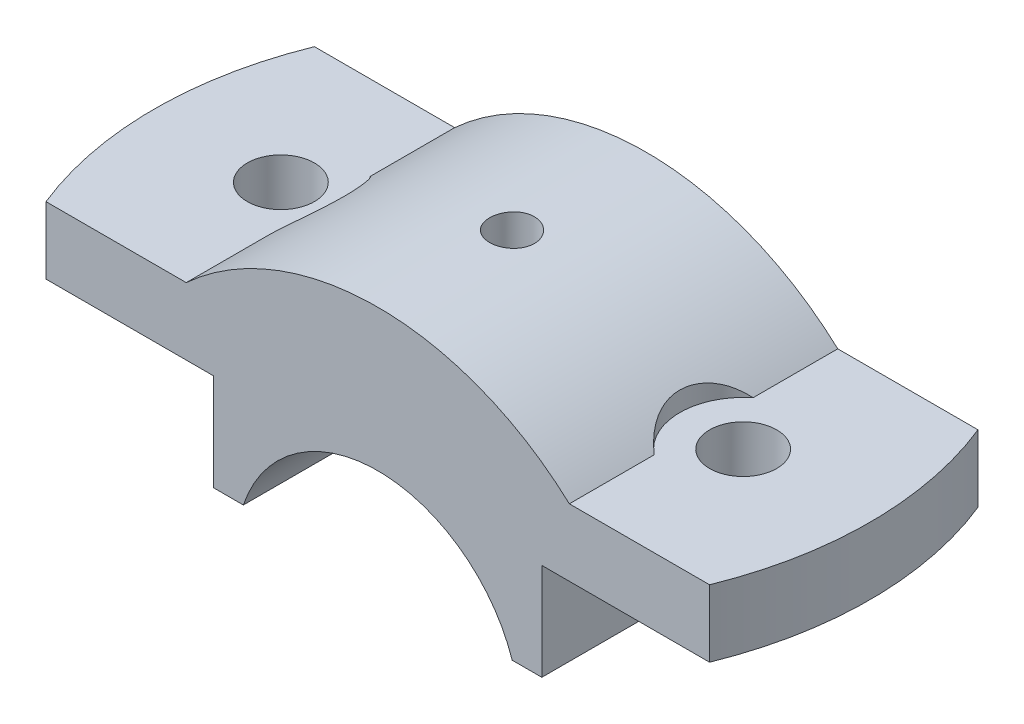
ISO-10303-21;
HEADER;
FILE_DESCRIPTION(('STEP AP214'),'2;1');
FILE_NAME('part.step','',(''),(''),'','','');
FILE_SCHEMA(('AUTOMOTIVE_DESIGN { 1 0 10303 214 1 1 1 1 }'));
ENDSEC;
DATA;
#1=APPLICATION_CONTEXT('core data for automotive mechanical design processes');
#2=APPLICATION_PROTOCOL_DEFINITION('international standard','automotive_design',2000,#1);
#3=PRODUCT_CONTEXT('',#1,'mechanical');
#4=PRODUCT('Part','Part','',(#3));
#5=PRODUCT_RELATED_PRODUCT_CATEGORY('part','',(#4));
#6=PRODUCT_DEFINITION_FORMATION('','',#4);
#7=PRODUCT_DEFINITION_CONTEXT('part definition',#1,'design');
#8=PRODUCT_DEFINITION('design','',#6,#7);
#9=PRODUCT_DEFINITION_SHAPE('','',#8);
#10=(LENGTH_UNIT() NAMED_UNIT(*) SI_UNIT(.MILLI.,.METRE.));
#11=(NAMED_UNIT(*) PLANE_ANGLE_UNIT() SI_UNIT($,.RADIAN.));
#12=(NAMED_UNIT(*) SI_UNIT($,.STERADIAN.) SOLID_ANGLE_UNIT());
#13=UNCERTAINTY_MEASURE_WITH_UNIT(LENGTH_MEASURE(1.E-05),#10,'distance_accuracy_value','');
#14=(GEOMETRIC_REPRESENTATION_CONTEXT(3) GLOBAL_UNCERTAINTY_ASSIGNED_CONTEXT((#13)) GLOBAL_UNIT_ASSIGNED_CONTEXT((#10,
#11,#12)) REPRESENTATION_CONTEXT('',''));
#15=CARTESIAN_POINT('',(0.,0.,0.));
#16=DIRECTION('',(0.,0.,1.));
#17=DIRECTION('',(1.,0.,0.));
#18=AXIS2_PLACEMENT_3D('',#15,#16,#17);
#19=CARTESIAN_POINT('',(0.,0.,18.));
#20=DIRECTION('',(0.,0.,-1.));
#21=DIRECTION('',(-1.,0.,0.));
#22=AXIS2_PLACEMENT_3D('',#19,#20,#21);
#23=CYLINDRICAL_SURFACE('',#22,38.);
#24=CARTESIAN_POINT('',(0.,38.,3.));
#25=CARTESIAN_POINT('',(-0.168230277437706,37.9999984430739,2.99999263868346));
#26=CARTESIAN_POINT('',(-0.336575845655095,37.9988709200709,2.98580169916932));
#27=CARTESIAN_POINT('',(-0.668611397196742,37.9944814128081,2.92939894930334));
#28=CARTESIAN_POINT('',(-0.832295850092009,37.9912169949171,2.88715518982943));
#29=CARTESIAN_POINT('',(-1.15015205512757,37.9829226863334,2.77587406357067));
#30=CARTESIAN_POINT('',(-1.3043290493551,37.9778937789402,2.70685161752221));
#31=CARTESIAN_POINT('',(-1.59887136159142,37.9666348413683,2.54399853963546));
#32=CARTESIAN_POINT('',(-1.73923967362019,37.9604050724332,2.45017330191646));
#33=CARTESIAN_POINT('',(-2.00254103126273,37.9474277075509,2.24014409327319));
#34=CARTESIAN_POINT('',(-2.12543792166293,37.9406790810774,2.1238948563935));
#35=CARTESIAN_POINT('',(-2.34999780988339,37.9274332919605,1.87241281605956));
#36=CARTESIAN_POINT('',(-2.45165988585508,37.9209361402441,1.73717918887839));
#37=CARTESIAN_POINT('',(-2.63098484586303,37.9089176287414,1.45135065682847));
#38=CARTESIAN_POINT('',(-2.708616254697,37.903397552738,1.30073594623715));
#39=CARTESIAN_POINT('',(-2.83747510230931,37.8939696224707,0.988558849059876));
#40=CARTESIAN_POINT('',(-2.8887029645124,37.8900617423529,0.826996638082311));
#41=CARTESIAN_POINT('',(-2.96319644645853,37.8843090780475,0.497870679819642));
#42=CARTESIAN_POINT('',(-2.98652059882487,37.8824599758018,0.33032025735777));
#43=CARTESIAN_POINT('',(-3.00472536931326,37.8810204867557,-0.00632681714998032));
#44=CARTESIAN_POINT('',(-2.99960647157769,37.8814300615093,-0.175423442828302));
#45=CARTESIAN_POINT('',(-2.96111886260011,37.8844577346025,-0.509962310035282));
#46=CARTESIAN_POINT('',(-2.92781369865023,37.8870708648728,-0.675411913710737));
#47=CARTESIAN_POINT('',(-2.83399765916123,37.8942034046858,-0.998365215123264));
#48=CARTESIAN_POINT('',(-2.77348654183749,37.8987228311701,-1.15586884222906));
#49=CARTESIAN_POINT('',(-2.62690490032728,37.9091644380148,-1.45866214971911));
#50=CARTESIAN_POINT('',(-2.5408057912968,37.9150881856644,-1.60393793599879));
#51=CARTESIAN_POINT('',(-2.34551283184453,37.9276694800349,-1.87799978791044));
#52=CARTESIAN_POINT('',(-2.23631856235736,37.9343270400699,-2.0067855542603));
#53=CARTESIAN_POINT('',(-1.99757813910437,37.947647885739,-2.24458115896057));
#54=CARTESIAN_POINT('',(-1.86797703439473,37.9543111370687,-2.35353583758634));
#55=CARTESIAN_POINT('',(-1.59229376436977,37.9668751419437,-2.54815019879117));
#56=CARTESIAN_POINT('',(-1.44621158946689,37.9727758950454,-2.63380986781872));
#57=CARTESIAN_POINT('',(-1.14167761997914,37.983150993084,-2.77939892547026));
#58=CARTESIAN_POINT('',(-0.98322469233549,37.9876252071703,-2.83932595392176));
#59=CARTESIAN_POINT('',(-0.658463212690179,37.9946415451888,-2.93171041942903));
#60=CARTESIAN_POINT('',(-0.492154807064348,37.997183705107,-2.96416836811962));
#61=CARTESIAN_POINT('',(-0.156881478742687,38.0000448768352,-3.00062434440681));
#62=CARTESIAN_POINT('',(0.0120751089608354,38.0003698415183,-3.00469857910482));
#63=CARTESIAN_POINT('',(0.348269003373997,37.9987758913175,-2.98447098943403));
#64=CARTESIAN_POINT('',(0.515506324442481,37.9968569951891,-2.96016940224689));
#65=CARTESIAN_POINT('',(0.843297753735753,37.9909950041868,-2.88394314979588));
#66=CARTESIAN_POINT('',(1.00386010671882,37.987054491835,-2.83205372367032));
#67=CARTESIAN_POINT('',(1.31399900365978,37.9775920824189,-2.70216068710783));
#68=CARTESIAN_POINT('',(1.46357539119334,37.972070162843,-2.62415670492505));
#69=CARTESIAN_POINT('',(1.74784375041781,37.9600494395666,-2.4440567104013));
#70=CARTESIAN_POINT('',(1.88250358772923,37.953548595394,-2.34191011569746));
#71=CARTESIAN_POINT('',(2.13279217984117,37.9403075453845,-2.1164976605111));
#72=CARTESIAN_POINT('',(2.24842063776818,37.9335673358158,-1.99323147064188));
#73=CARTESIAN_POINT('',(2.45762484975141,37.9205896766453,-1.72874864835166));
#74=CARTESIAN_POINT('',(2.55115094155127,37.9143533795852,-1.5874926690468));
#75=CARTESIAN_POINT('',(2.71315523827201,37.9031055627809,-1.29123629441747));
#76=CARTESIAN_POINT('',(2.78163367119924,37.8980940318878,-1.1362360242219));
#77=CARTESIAN_POINT('',(2.89151387110069,37.8898693720601,-0.817068099787171));
#78=CARTESIAN_POINT('',(2.93294623887225,37.8866542112497,-0.652911034998949));
#79=CARTESIAN_POINT('',(2.98765790023767,37.8823793491511,-0.319943850373175));
#80=CARTESIAN_POINT('',(3.00093767292138,37.8813196111828,-0.151133809767671));
#81=CARTESIAN_POINT('',(2.99896188688676,37.8814760426207,0.185853858942921));
#82=CARTESIAN_POINT('',(2.98378436644712,37.8826859878913,0.354031953001598));
#83=CARTESIAN_POINT('',(2.92548733876923,37.887232237977,0.685442873019109));
#84=CARTESIAN_POINT('',(2.8823677867555,37.8905685461995,0.848675691052987));
#85=CARTESIAN_POINT('',(2.76943001015431,37.8989899804525,1.16556899687011));
#86=CARTESIAN_POINT('',(2.69961296444522,37.9040750292632,1.31922990697071));
#87=CARTESIAN_POINT('',(2.535271096382,37.9154210711218,1.61266178094886));
#88=CARTESIAN_POINT('',(2.44074672054795,37.9216820429175,1.75243299578316));
#89=CARTESIAN_POINT('',(2.2293806238227,37.9346948182221,2.01451680288399));
#90=CARTESIAN_POINT('',(2.11248130954252,37.941447859921,2.13678288515433));
#91=CARTESIAN_POINT('',(1.85978424897896,37.954672635902,2.36000556130417));
#92=CARTESIAN_POINT('',(1.72398192526551,37.9611443015481,2.46095697881558));
#93=CARTESIAN_POINT('',(1.43709756450134,37.9730876131211,2.63880542567551));
#94=CARTESIAN_POINT('',(1.28598975831931,37.978557527474,2.71566096437293));
#95=CARTESIAN_POINT('',(0.973076064569833,37.9878601967286,2.84281200189951));
#96=CARTESIAN_POINT('',(0.811282773093933,37.9916948408735,2.89313816633252));
#97=CARTESIAN_POINT('',(0.540438770546247,37.9963056825779,2.95292296572034));
#98=CARTESIAN_POINT('',(0.433132098217291,37.9976847801056,2.97055353917028));
#99=CARTESIAN_POINT('',(0.217232975456251,37.9995324404705,2.99409441950641));
#100=CARTESIAN_POINT('',(0.108640528034263,38.0000010054389,3.0000047538251));
#101=CARTESIAN_POINT('',(0.,38.,3.));
#102=B_SPLINE_CURVE_WITH_KNOTS('',3,(#24,#25,#26,#27,#28,#29,#30,#31,#32,#33,#34,#35,#36,#37,
#38,#39,#40,#41,#42,#43,#44,#45,#46,#47,#48,#49,#50,#51,#52,#53,#54,#55,#56,#57,#58,#59,#60,#61,
#62,#63,#64,#65,#66,#67,#68,#69,#70,#71,#72,#73,#74,#75,#76,#77,#78,#79,#80,#81,#82,#83,#84,#85,
#86,#87,#88,#89,#90,#91,#92,#93,#94,#95,#96,#97,#98,#99,#100,#101),.UNSPECIFIED.,.T.,.F.,(4,2,2,
2,2,2,2,2,2,2,2,2,2,2,2,2,2,2,2,2,2,2,2,2,2,2,2,2,2,2,2,2,2,2,2,2,2,2,4),(0.,0.504294188546741,
1.00916370078727,1.51375230936014,2.01823126998903,2.5237394549149,3.0292695804704,
3.53545907123702,4.04164044416132,4.54675814609822,5.05186725021796,5.55584058602809,
6.05981840083594,6.56436134901273,7.06891345298729,7.57484819748389,8.0807832362998,
8.5867646690735,9.09273667730812,9.59734968185781,10.1019584685879,10.6059242398503,
11.1098971854695,11.614935538604,12.1199817691652,12.6261522324058,13.1323180879118,
13.6379102536977,14.1434938154447,14.6476929456065,15.1518928837201,15.6560705605014,
16.1602391262259,16.6657233184336,17.1713301290485,17.6778028214878,18.183688785524,
18.5093549854357,18.8350204230892),.UNSPECIFIED.);
#103=CARTESIAN_POINT('',(0.,38.,3.));
#104=VERTEX_POINT('',#103);
#105=EDGE_CURVE('E11',#104,#104,#102,.T.);
#106=ORIENTED_EDGE('',*,*,#105,.T.);
#107=EDGE_LOOP('',(#106));
#108=FACE_BOUND('',#107,.T.);
#109=DIRECTION('',(0.,0.,-1.));
#110=VECTOR('',#109,1.);
#111=CARTESIAN_POINT('',(25.6904651573303,28.,18.));
#112=LINE('',#111,#110);
#113=CARTESIAN_POINT('',(25.6904651573303,28.,18.));
#114=VERTEX_POINT('',#113);
#115=CARTESIAN_POINT('',(25.6904651573303,28.,6.63768331230679));
#116=VERTEX_POINT('',#115);
#117=EDGE_CURVE('E148',#114,#116,#112,.T.);
#118=ORIENTED_EDGE('',*,*,#117,.T.);
#119=CARTESIAN_POINT('',(25.6904651573303,28.,6.63768331230679));
#120=CARTESIAN_POINT('',(25.5360851043424,28.1416681018721,6.51420867249736));
#121=CARTESIAN_POINT('',(25.3836215551735,28.2791823336498,6.38340380017067));
#122=CARTESIAN_POINT('',(25.0841053598261,28.5451833866574,6.1068595072457));
#123=CARTESIAN_POINT('',(24.9370580895264,28.6736613482156,5.96110576476093));
#124=CARTESIAN_POINT('',(24.6491941230388,28.9215085426633,5.653491442262));
#125=CARTESIAN_POINT('',(24.508431723833,29.0408031542341,5.49151942353939));
#126=CARTESIAN_POINT('',(24.2363075607749,29.2682904084011,5.15263687836668));
#127=CARTESIAN_POINT('',(24.1049430857226,29.3764862568107,4.97573069263071));
#128=CARTESIAN_POINT('',(23.8528205053459,29.5815743674557,4.60631493821572));
#129=CARTESIAN_POINT('',(23.7321338833277,29.6783916917415,4.41371469093334));
#130=CARTESIAN_POINT('',(23.5043908446779,29.85908164754,4.01479632179464));
#131=CARTESIAN_POINT('',(23.3973358972541,29.942952883943,3.80847672492269));
#132=CARTESIAN_POINT('',(23.1992536300817,30.0966827286364,3.38422419101504));
#133=CARTESIAN_POINT('',(23.1081729651954,30.1665880882949,3.1663331999127));
#134=CARTESIAN_POINT('',(22.9434688496595,30.2920447623401,2.72008092153074));
#135=CARTESIAN_POINT('',(22.869842066784,30.347598816803,2.49172164276593));
#136=CARTESIAN_POINT('',(22.7499342032063,30.4375648556656,2.05682098381956));
#137=CARTESIAN_POINT('',(22.7013462567531,30.4737833576563,1.85128534823191));
#138=CARTESIAN_POINT('',(22.6194172898017,30.534645499234,1.43551725204115));
#139=CARTESIAN_POINT('',(22.5860747992536,30.5592902548309,1.22528524633891));
#140=CARTESIAN_POINT('',(22.5352129551669,30.5968164834569,0.801799591498528));
#141=CARTESIAN_POINT('',(22.5176992505084,30.6096937569973,0.588544891193922));
#142=CARTESIAN_POINT('',(22.4988301660851,30.6235658271181,0.160939560666236));
#143=CARTESIAN_POINT('',(22.4974739036633,30.624561272785,-0.0534110090511308));
#144=CARTESIAN_POINT('',(22.5103301119086,30.6151119876343,-0.461997479818147));
#145=CARTESIAN_POINT('',(22.5231488228924,30.6056914251709,-0.656303160135773));
#146=CARTESIAN_POINT('',(22.5619809221014,30.5770763766543,-1.04286259298841));
#147=CARTESIAN_POINT('',(22.5879939672906,30.5578821447042,-1.23511639873688));
#148=CARTESIAN_POINT('',(22.6528192304938,30.5098574663833,-1.61613906729809));
#149=CARTESIAN_POINT('',(22.6916259266854,30.4810311771979,-1.80490939654948));
#150=CARTESIAN_POINT('',(22.7814851533843,30.4139289484325,-2.17779604427594));
#151=CARTESIAN_POINT('',(22.8325379785097,30.3756527815061,-2.36191225066402));
#152=CARTESIAN_POINT('',(22.9463727274414,30.2897519777021,-2.72495933677603));
#153=CARTESIAN_POINT('',(23.0091940590921,30.2420959034169,-2.90387039063447));
#154=CARTESIAN_POINT('',(23.1456283742011,30.1378044455698,-3.2548914886335));
#155=CARTESIAN_POINT('',(23.2192449894415,30.0811660396201,-3.42699921914349));
#156=CARTESIAN_POINT('',(23.3763137314078,29.9592695660632,-3.76349373210636));
#157=CARTESIAN_POINT('',(23.4597660818508,29.8940113023904,-3.92788033882066));
#158=CARTESIAN_POINT('',(23.635527045378,29.7552415450916,-4.24828704232643));
#159=CARTESIAN_POINT('',(23.7278387953854,29.6817271265587,-4.40430414494655));
#160=CARTESIAN_POINT('',(23.9282386479047,29.5204551498758,-4.71995510834891));
#161=CARTESIAN_POINT('',(24.0370002176616,29.432022004933,-4.87881602386905));
#162=CARTESIAN_POINT('',(24.2623844714665,29.2465042091278,-5.1856332961988));
#163=CARTESIAN_POINT('',(24.379010630913,29.1494157272481,-5.33358477081362));
#164=CARTESIAN_POINT('',(24.6187042069683,28.9472618083659,-5.61815393006346));
#165=CARTESIAN_POINT('',(24.7417672458198,28.8422017715012,-5.75477915839727));
#166=CARTESIAN_POINT('',(24.9931857635632,28.6246099475779,-6.016738259449));
#167=CARTESIAN_POINT('',(25.121541230047,28.5120781780363,-6.14207215863704));
#168=CARTESIAN_POINT('',(25.3239635142993,28.3320696328102,-6.32788833390874));
#169=CARTESIAN_POINT('',(25.3966039536003,28.2669811541268,-6.39227987552885));
#170=CARTESIAN_POINT('',(25.5428336292653,28.1349133065772,-6.51755974656749));
#171=CARTESIAN_POINT('',(25.6164208573993,28.0679376662269,-6.57845434819234));
#172=CARTESIAN_POINT('',(25.6904651573302,28.0000000000002,-6.63768331230705));
#173=B_SPLINE_CURVE_WITH_KNOTS('',3,(#119,#120,#121,#122,#123,#124,#125,#126,#127,#128,#129,
#130,#131,#132,#133,#134,#135,#136,#137,#138,#139,#140,#141,#142,#143,#144,#145,#146,#147,#148,
#149,#150,#151,#152,#153,#154,#155,#156,#157,#158,#159,#160,#161,#162,#163,#164,#165,#166,#167,
#168,#169,#170,#171,#172),.UNSPECIFIED.,.F.,.F.,(4,2,2,2,2,2,2,2,2,2,2,2,2,2,2,2,2,2,2,2,2,2,2,
2,2,2,4),(0.,0.729592400834071,1.45989044138352,2.19560470883998,2.93110586753775,
3.67120763552798,4.41138910352642,5.14904966030396,5.88656927223679,6.52855006409984,
7.17046893961488,7.8126168088522,8.45472959834445,9.03890309081731,9.62306139629813,
10.2069679046447,10.7908884620571,11.3768004587137,11.9629100238154,12.549032922753,
13.1353641263273,13.7703169673958,14.4055522594533,15.040361004022,15.6751682603777,
16.0257258218313,16.3756336015193),.UNSPECIFIED.);
#174=CARTESIAN_POINT('',(25.6904651573303,28.,-6.63768331230678));
#175=VERTEX_POINT('',#174);
#176=EDGE_CURVE('E140',#116,#175,#173,.T.);
#177=ORIENTED_EDGE('',*,*,#176,.T.);
#178=CARTESIAN_POINT('',(25.6904651573303,28.,-18.));
#179=VERTEX_POINT('',#178);
#180=EDGE_CURVE('E145',#175,#179,#112,.T.);
#181=ORIENTED_EDGE('',*,*,#180,.T.);
#182=CARTESIAN_POINT('',(0.,0.,-18.));
#183=DIRECTION('',(0.,0.,1.));
#184=DIRECTION('',(1.,0.,0.));
#185=AXIS2_PLACEMENT_3D('',#182,#183,#184);
#186=CIRCLE('',#185,38.);
#187=CARTESIAN_POINT('',(-25.6904651573303,28.,-18.));
#188=VERTEX_POINT('',#187);
#189=EDGE_CURVE('E301',#179,#188,#186,.T.);
#190=ORIENTED_EDGE('',*,*,#189,.T.);
#191=DIRECTION('',(0.,0.,-1.));
#192=VECTOR('',#191,1.);
#193=CARTESIAN_POINT('',(-25.6904651573303,28.,18.));
#194=LINE('',#193,#192);
#195=CARTESIAN_POINT('',(-25.6904651573303,28.,-6.63768331230678));
#196=VERTEX_POINT('',#195);
#197=EDGE_CURVE('E181',#196,#188,#194,.T.);
#198=ORIENTED_EDGE('',*,*,#197,.F.);
#199=CARTESIAN_POINT('',(-25.6904651573303,28.,6.63768331230679));
#200=CARTESIAN_POINT('',(-25.5360851043424,28.1416681018721,6.51420867249736));
#201=CARTESIAN_POINT('',(-25.3836215551735,28.2791823336498,6.38340380017067));
#202=CARTESIAN_POINT('',(-25.0841053598261,28.5451833866574,6.1068595072457));
#203=CARTESIAN_POINT('',(-24.9370580895264,28.6736613482156,5.96110576476092));
#204=CARTESIAN_POINT('',(-24.6491941230388,28.9215085426633,5.65349144226199));
#205=CARTESIAN_POINT('',(-24.508431723833,29.0408031542341,5.49151942353938));
#206=CARTESIAN_POINT('',(-24.2363075607749,29.2682904084011,5.15263687836668));
#207=CARTESIAN_POINT('',(-24.1049430857226,29.3764862568107,4.97573069263071));
#208=CARTESIAN_POINT('',(-23.8528205053459,29.5815743674557,4.60631493821571));
#209=CARTESIAN_POINT('',(-23.7321338833277,29.6783916917415,4.41371469093333));
#210=CARTESIAN_POINT('',(-23.5043908446779,29.85908164754,4.01479632179464));
#211=CARTESIAN_POINT('',(-23.3973358972541,29.942952883943,3.80847672492269));
#212=CARTESIAN_POINT('',(-23.1992536300817,30.0966827286364,3.38422419101503));
#213=CARTESIAN_POINT('',(-23.1081729651954,30.1665880882949,3.16633319991269));
#214=CARTESIAN_POINT('',(-22.9434688496595,30.2920447623401,2.72008092153074));
#215=CARTESIAN_POINT('',(-22.869842066784,30.347598816803,2.49172164276592));
#216=CARTESIAN_POINT('',(-22.7499342032063,30.4375648556656,2.05682098381955));
#217=CARTESIAN_POINT('',(-22.7013462567531,30.4737833576563,1.85128534823191));
#218=CARTESIAN_POINT('',(-22.6194172898017,30.534645499234,1.43551725204114));
#219=CARTESIAN_POINT('',(-22.5860747992536,30.5592902548309,1.2252852463389));
#220=CARTESIAN_POINT('',(-22.5352129551669,30.5968164834569,0.801799591498522));
#221=CARTESIAN_POINT('',(-22.5176992505084,30.6096937569973,0.588544891193915));
#222=CARTESIAN_POINT('',(-22.4988301660851,30.6235658271181,0.160939560666228));
#223=CARTESIAN_POINT('',(-22.4974739036633,30.624561272785,-0.0534110090511391));
#224=CARTESIAN_POINT('',(-22.5103301119086,30.6151119876343,-0.461997479818155));
#225=CARTESIAN_POINT('',(-22.5231488228924,30.6056914251709,-0.656303160135781));
#226=CARTESIAN_POINT('',(-22.5619809221014,30.5770763766543,-1.04286259298842));
#227=CARTESIAN_POINT('',(-22.5879939672906,30.5578821447042,-1.23511639873689));
#228=CARTESIAN_POINT('',(-22.6528192304938,30.5098574663833,-1.6161390672981));
#229=CARTESIAN_POINT('',(-22.6916259266854,30.4810311771979,-1.80490939654949));
#230=CARTESIAN_POINT('',(-22.7814851533843,30.4139289484325,-2.17779604427594));
#231=CARTESIAN_POINT('',(-22.8325379785097,30.3756527815061,-2.36191225066403));
#232=CARTESIAN_POINT('',(-22.9463727274414,30.2897519777021,-2.72495933677603));
#233=CARTESIAN_POINT('',(-23.0091940590921,30.2420959034169,-2.90387039063448));
#234=CARTESIAN_POINT('',(-23.1456283742011,30.1378044455698,-3.25489148863351));
#235=CARTESIAN_POINT('',(-23.2192449894415,30.0811660396201,-3.4269992191435));
#236=CARTESIAN_POINT('',(-23.3763137314078,29.9592695660632,-3.76349373210637));
#237=CARTESIAN_POINT('',(-23.4597660818508,29.8940113023904,-3.92788033882066));
#238=CARTESIAN_POINT('',(-23.635527045378,29.7552415450916,-4.24828704232643));
#239=CARTESIAN_POINT('',(-23.7278387953854,29.6817271265587,-4.40430414494656));
#240=CARTESIAN_POINT('',(-23.9282386479047,29.5204551498757,-4.71995510834892));
#241=CARTESIAN_POINT('',(-24.0370002176616,29.432022004933,-4.87881602386906));
#242=CARTESIAN_POINT('',(-24.2623844714665,29.2465042091278,-5.18563329619881));
#243=CARTESIAN_POINT('',(-24.379010630913,29.1494157272481,-5.33358477081363));
#244=CARTESIAN_POINT('',(-24.6187042069683,28.9472618083659,-5.61815393006347));
#245=CARTESIAN_POINT('',(-24.7417672458198,28.8422017715012,-5.75477915839728));
#246=CARTESIAN_POINT('',(-24.9931857635632,28.6246099475779,-6.01673825944901));
#247=CARTESIAN_POINT('',(-25.121541230047,28.5120781780363,-6.14207215863705));
#248=CARTESIAN_POINT('',(-25.3239635142993,28.3320696328102,-6.32788833390874));
#249=CARTESIAN_POINT('',(-25.3966039536003,28.2669811541268,-6.39227987552885));
#250=CARTESIAN_POINT('',(-25.5428336292653,28.1349133065772,-6.51755974656749));
#251=CARTESIAN_POINT('',(-25.6164208573994,28.0679376662269,-6.57845434819234));
#252=CARTESIAN_POINT('',(-25.6904651573302,28.0000000000002,-6.63768331230705));
#253=B_SPLINE_CURVE_WITH_KNOTS('',3,(#199,#200,#201,#202,#203,#204,#205,#206,#207,#208,#209,
#210,#211,#212,#213,#214,#215,#216,#217,#218,#219,#220,#221,#222,#223,#224,#225,#226,#227,#228,
#229,#230,#231,#232,#233,#234,#235,#236,#237,#238,#239,#240,#241,#242,#243,#244,#245,#246,#247,
#248,#249,#250,#251,#252),.UNSPECIFIED.,.F.,.F.,(4,2,2,2,2,2,2,2,2,2,2,2,2,2,2,2,2,2,2,2,2,2,2,
2,2,2,4),(0.,0.729592400834072,1.45989044138351,2.19560470883998,2.93110586753775,
3.67120763552798,4.41138910352642,5.14904966030396,5.88656927223679,6.52855006409984,
7.17046893961488,7.8126168088522,8.45472959834445,9.03890309081732,9.62306139629814,
10.2069679046447,10.7908884620571,11.3768004587137,11.9629100238154,12.549032922753,
13.1353641263273,13.7703169673958,14.4055522594533,15.040361004022,15.6751682603777,
16.0257258218313,16.3756336015193),.UNSPECIFIED.);
#254=CARTESIAN_POINT('',(-25.6904651573303,28.,6.63768331230679));
#255=VERTEX_POINT('',#254);
#256=EDGE_CURVE('E46',#255,#196,#253,.T.);
#257=ORIENTED_EDGE('',*,*,#256,.F.);
#258=CARTESIAN_POINT('',(-25.6904651573303,28.,18.));
#259=VERTEX_POINT('',#258);
#260=EDGE_CURVE('E182',#259,#255,#194,.T.);
#261=ORIENTED_EDGE('',*,*,#260,.F.);
#262=CARTESIAN_POINT('',(0.,0.,18.));
#263=DIRECTION('',(0.,0.,1.));
#264=DIRECTION('',(1.,0.,0.));
#265=AXIS2_PLACEMENT_3D('',#262,#263,#264);
#266=CIRCLE('',#265,38.);
#267=EDGE_CURVE('E281',#114,#259,#266,.T.);
#268=ORIENTED_EDGE('',*,*,#267,.F.);
#269=EDGE_LOOP('',(#118,#177,#181,#190,#198,#257,#261,#268));
#270=FACE_BOUND('',#269,.T.);
#271=ADVANCED_FACE('F33',(#108,#270),#23,.T.);
#272=CARTESIAN_POINT('',(-50.,28.,18.));
#273=DIRECTION('',(0.,-1.,0.));
#274=DIRECTION('',(1.,0.,0.));
#275=AXIS2_PLACEMENT_3D('',#272,#273,#274);
#276=PLANE('',#275);
#277=CARTESIAN_POINT('',(-31.,28.,0.));
#278=DIRECTION('',(0.,1.,0.));
#279=DIRECTION('',(-1.,0.,0.));
#280=AXIS2_PLACEMENT_3D('',#277,#278,#279);
#281=CIRCLE('',#280,4.5);
#282=CARTESIAN_POINT('',(-35.5,28.,0.));
#283=VERTEX_POINT('',#282);
#284=EDGE_CURVE('E190',#283,#283,#281,.T.);
#285=ORIENTED_EDGE('',*,*,#284,.F.);
#286=EDGE_LOOP('',(#285));
#287=FACE_BOUND('',#286,.T.);
#288=CARTESIAN_POINT('',(0.,28.,0.));
#289=DIRECTION('',(0.,1.,0.));
#290=DIRECTION('',(-1.,0.,0.));
#291=AXIS2_PLACEMENT_3D('',#288,#289,#290);
#292=CIRCLE('',#291,48.);
#293=CARTESIAN_POINT('',(-44.497190922574,28.,-18.));
#294=VERTEX_POINT('',#293);
#295=CARTESIAN_POINT('',(-44.497190922574,28.,18.));
#296=VERTEX_POINT('',#295);
#297=EDGE_CURVE('E189',#294,#296,#292,.T.);
#298=ORIENTED_EDGE('',*,*,#297,.T.);
#299=DIRECTION('',(-1.,0.,0.));
#300=VECTOR('',#299,1.);
#301=CARTESIAN_POINT('',(-50.,28.,18.));
#302=LINE('',#301,#300);
#303=EDGE_CURVE('E271',#259,#296,#302,.T.);
#304=ORIENTED_EDGE('',*,*,#303,.F.);
#305=ORIENTED_EDGE('',*,*,#260,.T.);
#306=CARTESIAN_POINT('',(-31.,28.,0.));
#307=DIRECTION('',(0.,1.,0.));
#308=DIRECTION('',(-1.,0.,0.));
#309=AXIS2_PLACEMENT_3D('',#306,#307,#308);
#310=CIRCLE('',#309,8.5);
#311=EDGE_CURVE('E61',#255,#196,#310,.T.);
#312=ORIENTED_EDGE('',*,*,#311,.T.);
#313=ORIENTED_EDGE('',*,*,#197,.T.);
#314=DIRECTION('',(-1.,0.,0.));
#315=VECTOR('',#314,1.);
#316=CARTESIAN_POINT('',(-50.,28.,-18.));
#317=LINE('',#316,#315);
#318=EDGE_CURVE('E274',#188,#294,#317,.T.);
#319=ORIENTED_EDGE('',*,*,#318,.T.);
#320=EDGE_LOOP('',(#298,#304,#305,#312,#313,#319));
#321=FACE_BOUND('',#320,.T.);
#322=ADVANCED_FACE('F258',(#287,#321),#276,.F.);
#323=CARTESIAN_POINT('',(-22.,19.,18.));
#324=DIRECTION('',(0.,1.,0.));
#325=DIRECTION('',(0.,0.,1.));
#326=AXIS2_PLACEMENT_3D('',#323,#324,#325);
#327=PLANE('',#326);
#328=CARTESIAN_POINT('',(-31.,19.,0.));
#329=DIRECTION('',(0.,1.,0.));
#330=DIRECTION('',(0.,0.,1.));
#331=AXIS2_PLACEMENT_3D('',#328,#329,#330);
#332=CIRCLE('',#331,4.5);
#333=CARTESIAN_POINT('',(-31.,19.,4.5));
#334=VERTEX_POINT('',#333);
#335=EDGE_CURVE('E186',#334,#334,#332,.T.);
#336=ORIENTED_EDGE('',*,*,#335,.T.);
#337=EDGE_LOOP('',(#336));
#338=FACE_BOUND('',#337,.T.);
#339=CARTESIAN_POINT('',(0.,19.,0.));
#340=DIRECTION('',(0.,1.,0.));
#341=DIRECTION('',(0.,0.,1.));
#342=AXIS2_PLACEMENT_3D('',#339,#340,#341);
#343=CIRCLE('',#342,48.);
#344=CARTESIAN_POINT('',(-44.497190922574,19.,-18.));
#345=VERTEX_POINT('',#344);
#346=CARTESIAN_POINT('',(-44.497190922574,19.,18.));
#347=VERTEX_POINT('',#346);
#348=EDGE_CURVE('E303',#345,#347,#343,.T.);
#349=ORIENTED_EDGE('',*,*,#348,.F.);
#350=DIRECTION('',(1.,0.,0.));
#351=VECTOR('',#350,1.);
#352=CARTESIAN_POINT('',(-22.,19.,-18.));
#353=LINE('',#352,#351);
#354=CARTESIAN_POINT('',(-22.,19.,-18.));
#355=VERTEX_POINT('',#354);
#356=EDGE_CURVE('E305',#345,#355,#353,.T.);
#357=ORIENTED_EDGE('',*,*,#356,.T.);
#358=DIRECTION('',(0.,0.,-1.));
#359=VECTOR('',#358,1.);
#360=CARTESIAN_POINT('',(-22.,19.,18.));
#361=LINE('',#360,#359);
#362=CARTESIAN_POINT('',(-22.,19.,18.));
#363=VERTEX_POINT('',#362);
#364=EDGE_CURVE('E178',#363,#355,#361,.T.);
#365=ORIENTED_EDGE('',*,*,#364,.F.);
#366=DIRECTION('',(1.,0.,0.));
#367=VECTOR('',#366,1.);
#368=CARTESIAN_POINT('',(-22.,19.,18.));
#369=LINE('',#368,#367);
#370=EDGE_CURVE('E283',#347,#363,#369,.T.);
#371=ORIENTED_EDGE('',*,*,#370,.F.);
#372=EDGE_LOOP('',(#349,#357,#365,#371));
#373=FACE_BOUND('',#372,.T.);
#374=ADVANCED_FACE('F225',(#338,#373),#327,.F.);
#375=CARTESIAN_POINT('',(0.,0.,18.));
#376=DIRECTION('',(0.,0.,1.));
#377=DIRECTION('',(1.,0.,0.));
#378=AXIS2_PLACEMENT_3D('',#375,#376,#377);
#379=PLANE('',#378);
#380=DIRECTION('',(0.,1.,0.));
#381=VECTOR('',#380,1.);
#382=CARTESIAN_POINT('',(44.497190922574,-8.,18.));
#383=LINE('',#382,#381);
#384=CARTESIAN_POINT('',(44.497190922574,19.,18.));
#385=VERTEX_POINT('',#384);
#386=CARTESIAN_POINT('',(44.497190922574,28.,18.));
#387=VERTEX_POINT('',#386);
#388=EDGE_CURVE('E328',#385,#387,#383,.T.);
#389=ORIENTED_EDGE('',*,*,#388,.T.);
#390=DIRECTION('',(-1.,0.,0.));
#391=VECTOR('',#390,1.);
#392=CARTESIAN_POINT('',(25.6904651573303,28.,18.));
#393=LINE('',#392,#391);
#394=EDGE_CURVE('E156',#387,#114,#393,.T.);
#395=ORIENTED_EDGE('',*,*,#394,.T.);
#396=ORIENTED_EDGE('',*,*,#267,.T.);
#397=ORIENTED_EDGE('',*,*,#303,.T.);
#398=DIRECTION('',(0.,1.,0.));
#399=VECTOR('',#398,1.);
#400=CARTESIAN_POINT('',(-44.497190922574,-8.,18.));
#401=LINE('',#400,#399);
#402=EDGE_CURVE('E276',#347,#296,#401,.T.);
#403=ORIENTED_EDGE('',*,*,#402,.F.);
#404=ORIENTED_EDGE('',*,*,#370,.T.);
#405=DIRECTION('',(0.,-1.,0.));
#406=VECTOR('',#405,1.);
#407=CARTESIAN_POINT('',(-22.,6.,18.));
#408=LINE('',#407,#406);
#409=CARTESIAN_POINT('',(-22.,6.,18.));
#410=VERTEX_POINT('',#409);
#411=EDGE_CURVE('E285',#363,#410,#408,.T.);
#412=ORIENTED_EDGE('',*,*,#411,.T.);
#413=DIRECTION('',(1.,0.,0.));
#414=VECTOR('',#413,1.);
#415=CARTESIAN_POINT('',(-18.0277563773199,6.,18.));
#416=LINE('',#415,#414);
#417=CARTESIAN_POINT('',(-18.0277563773199,6.,18.));
#418=VERTEX_POINT('',#417);
#419=EDGE_CURVE('E291',#410,#418,#416,.T.);
#420=ORIENTED_EDGE('',*,*,#419,.T.);
#421=CARTESIAN_POINT('',(0.,0.,18.));
#422=DIRECTION('',(0.,0.,-1.));
#423=DIRECTION('',(1.,0.,0.));
#424=AXIS2_PLACEMENT_3D('',#421,#422,#423);
#425=CIRCLE('',#424,19.);
#426=CARTESIAN_POINT('',(18.0277563773199,6.,18.));
#427=VERTEX_POINT('',#426);
#428=EDGE_CURVE('E293',#418,#427,#425,.T.);
#429=ORIENTED_EDGE('',*,*,#428,.T.);
#430=DIRECTION('',(1.,0.,0.));
#431=VECTOR('',#430,1.);
#432=CARTESIAN_POINT('',(18.0277563773199,6.,18.));
#433=LINE('',#432,#431);
#434=CARTESIAN_POINT('',(22.,6.,18.));
#435=VERTEX_POINT('',#434);
#436=EDGE_CURVE('E295',#427,#435,#433,.T.);
#437=ORIENTED_EDGE('',*,*,#436,.T.);
#438=DIRECTION('',(0.,1.,0.));
#439=VECTOR('',#438,1.);
#440=CARTESIAN_POINT('',(22.,6.,18.));
#441=LINE('',#440,#439);
#442=CARTESIAN_POINT('',(22.,19.,18.));
#443=VERTEX_POINT('',#442);
#444=EDGE_CURVE('E297',#435,#443,#441,.T.);
#445=ORIENTED_EDGE('',*,*,#444,.T.);
#446=DIRECTION('',(1.,0.,0.));
#447=VECTOR('',#446,1.);
#448=CARTESIAN_POINT('',(22.,19.,18.));
#449=LINE('',#448,#447);
#450=EDGE_CURVE('E159',#443,#385,#449,.T.);
#451=ORIENTED_EDGE('',*,*,#450,.T.);
#452=EDGE_LOOP('',(#389,#395,#396,#397,#403,#404,#412,#420,#429,#437,#445,#451));
#453=FACE_BOUND('',#452,.T.);
#454=ADVANCED_FACE('F221',(#453),#379,.T.);
#455=CARTESIAN_POINT('',(0.,0.,-18.));
#456=DIRECTION('',(0.,0.,1.));
#457=DIRECTION('',(1.,0.,0.));
#458=AXIS2_PLACEMENT_3D('',#455,#456,#457);
#459=PLANE('',#458);
#460=DIRECTION('',(-1.,0.,0.));
#461=VECTOR('',#460,1.);
#462=CARTESIAN_POINT('',(25.6904651573303,28.,-18.));
#463=LINE('',#462,#461);
#464=CARTESIAN_POINT('',(44.497190922574,28.,-18.));
#465=VERTEX_POINT('',#464);
#466=EDGE_CURVE('E154',#465,#179,#463,.T.);
#467=ORIENTED_EDGE('',*,*,#466,.F.);
#468=DIRECTION('',(0.,1.,0.));
#469=VECTOR('',#468,1.);
#470=CARTESIAN_POINT('',(44.497190922574,-8.,-18.));
#471=LINE('',#470,#469);
#472=CARTESIAN_POINT('',(44.497190922574,19.,-18.));
#473=VERTEX_POINT('',#472);
#474=EDGE_CURVE('E327',#473,#465,#471,.T.);
#475=ORIENTED_EDGE('',*,*,#474,.F.);
#476=DIRECTION('',(1.,0.,0.));
#477=VECTOR('',#476,1.);
#478=CARTESIAN_POINT('',(22.,19.,-18.));
#479=LINE('',#478,#477);
#480=CARTESIAN_POINT('',(22.,19.,-18.));
#481=VERTEX_POINT('',#480);
#482=EDGE_CURVE('E316',#481,#473,#479,.T.);
#483=ORIENTED_EDGE('',*,*,#482,.F.);
#484=DIRECTION('',(0.,1.,0.));
#485=VECTOR('',#484,1.);
#486=CARTESIAN_POINT('',(22.,6.,-18.));
#487=LINE('',#486,#485);
#488=CARTESIAN_POINT('',(22.,6.,-18.));
#489=VERTEX_POINT('',#488);
#490=EDGE_CURVE('E315',#489,#481,#487,.T.);
#491=ORIENTED_EDGE('',*,*,#490,.F.);
#492=DIRECTION('',(1.,0.,0.));
#493=VECTOR('',#492,1.);
#494=CARTESIAN_POINT('',(18.0277563773199,6.,-18.));
#495=LINE('',#494,#493);
#496=CARTESIAN_POINT('',(18.0277563773199,6.,-18.));
#497=VERTEX_POINT('',#496);
#498=EDGE_CURVE('E313',#497,#489,#495,.T.);
#499=ORIENTED_EDGE('',*,*,#498,.F.);
#500=CARTESIAN_POINT('',(0.,0.,-18.));
#501=DIRECTION('',(0.,0.,-1.));
#502=DIRECTION('',(1.,0.,0.));
#503=AXIS2_PLACEMENT_3D('',#500,#501,#502);
#504=CIRCLE('',#503,19.);
#505=CARTESIAN_POINT('',(-18.0277563773199,6.,-18.));
#506=VERTEX_POINT('',#505);
#507=EDGE_CURVE('E311',#506,#497,#504,.T.);
#508=ORIENTED_EDGE('',*,*,#507,.F.);
#509=DIRECTION('',(1.,0.,0.));
#510=VECTOR('',#509,1.);
#511=CARTESIAN_POINT('',(-18.0277563773199,6.,-18.));
#512=LINE('',#511,#510);
#513=CARTESIAN_POINT('',(-22.,6.,-18.));
#514=VERTEX_POINT('',#513);
#515=EDGE_CURVE('E309',#514,#506,#512,.T.);
#516=ORIENTED_EDGE('',*,*,#515,.F.);
#517=DIRECTION('',(0.,-1.,0.));
#518=VECTOR('',#517,1.);
#519=CARTESIAN_POINT('',(-22.,6.,-18.));
#520=LINE('',#519,#518);
#521=EDGE_CURVE('E307',#355,#514,#520,.T.);
#522=ORIENTED_EDGE('',*,*,#521,.F.);
#523=ORIENTED_EDGE('',*,*,#356,.F.);
#524=DIRECTION('',(0.,1.,0.));
#525=VECTOR('',#524,1.);
#526=CARTESIAN_POINT('',(-44.497190922574,-8.,-18.));
#527=LINE('',#526,#525);
#528=EDGE_CURVE('E184',#294,#345,#527,.F.);
#529=ORIENTED_EDGE('',*,*,#528,.F.);
#530=ORIENTED_EDGE('',*,*,#318,.F.);
#531=ORIENTED_EDGE('',*,*,#189,.F.);
#532=EDGE_LOOP('',(#467,#475,#483,#491,#499,#508,#516,#522,#523,#529,#530,#531));
#533=FACE_BOUND('',#532,.T.);
#534=ADVANCED_FACE('F224',(#533),#459,.F.);
#535=CARTESIAN_POINT('',(-22.,6.,18.));
#536=DIRECTION('',(1.,0.,0.));
#537=DIRECTION('',(0.,0.,-1.));
#538=AXIS2_PLACEMENT_3D('',#535,#536,#537);
#539=PLANE('',#538);
#540=ORIENTED_EDGE('',*,*,#521,.T.);
#541=DIRECTION('',(0.,0.,-1.));
#542=VECTOR('',#541,1.);
#543=CARTESIAN_POINT('',(-22.,6.,18.));
#544=LINE('',#543,#542);
#545=EDGE_CURVE('E175',#410,#514,#544,.T.);
#546=ORIENTED_EDGE('',*,*,#545,.F.);
#547=ORIENTED_EDGE('',*,*,#411,.F.);
#548=ORIENTED_EDGE('',*,*,#364,.T.);
#549=EDGE_LOOP('',(#540,#546,#547,#548));
#550=FACE_BOUND('',#549,.T.);
#551=ADVANCED_FACE('F229',(#550),#539,.F.);
#552=CARTESIAN_POINT('',(-18.0277563773199,6.,18.));
#553=DIRECTION('',(0.,1.,0.));
#554=DIRECTION('',(-1.,0.,0.));
#555=AXIS2_PLACEMENT_3D('',#552,#553,#554);
#556=PLANE('',#555);
#557=ORIENTED_EDGE('',*,*,#515,.T.);
#558=DIRECTION('',(0.,0.,-1.));
#559=VECTOR('',#558,1.);
#560=CARTESIAN_POINT('',(-18.0277563773199,6.,18.));
#561=LINE('',#560,#559);
#562=EDGE_CURVE('E172',#418,#506,#561,.T.);
#563=ORIENTED_EDGE('',*,*,#562,.F.);
#564=ORIENTED_EDGE('',*,*,#419,.F.);
#565=ORIENTED_EDGE('',*,*,#545,.T.);
#566=EDGE_LOOP('',(#557,#563,#564,#565));
#567=FACE_BOUND('',#566,.T.);
#568=ADVANCED_FACE('F249',(#567),#556,.F.);
#569=CARTESIAN_POINT('',(0.,0.,18.));
#570=DIRECTION('',(0.,0.,-1.));
#571=DIRECTION('',(-1.,0.,0.));
#572=AXIS2_PLACEMENT_3D('',#569,#570,#571);
#573=CYLINDRICAL_SURFACE('',#572,19.);
#574=CARTESIAN_POINT('',(0.,19.,2.5));
#575=CARTESIAN_POINT('',(0.139778315489381,18.999997967774,2.49999410094607));
#576=CARTESIAN_POINT('',(0.279642447495432,18.9984412683557,2.48823767475851));
#577=CARTESIAN_POINT('',(0.555474474016764,18.9923810422329,2.44152700403634));
#578=CARTESIAN_POINT('',(0.691438217949603,18.9878744896332,2.40654893872552));
#579=CARTESIAN_POINT('',(0.955436642925263,18.9764219373405,2.31444705906101));
#580=CARTESIAN_POINT('',(1.08347675216936,18.9694776299244,2.25733860465933));
#581=CARTESIAN_POINT('',(1.32813277832855,18.9539206812215,2.12263165454414));
#582=CARTESIAN_POINT('',(1.44475055826477,18.9453083126858,2.04503650793576));
#583=CARTESIAN_POINT('',(1.66398308687909,18.9273173646443,1.87105538112386));
#584=CARTESIAN_POINT('',(1.76651843289981,18.9179348817316,1.77456973952705));
#585=CARTESIAN_POINT('',(1.95399133146887,18.8994924119599,1.56576064733009));
#586=CARTESIAN_POINT('',(2.0389279601093,18.890432442053,1.4534363657436));
#587=CARTESIAN_POINT('',(2.18909162338547,18.8736225658863,1.21561789849417));
#588=CARTESIAN_POINT('',(2.254243636291,18.8658776941045,1.09007595594653));
#589=CARTESIAN_POINT('',(2.36250946256607,18.8526269269547,0.829713309668851));
#590=CARTESIAN_POINT('',(2.40562420041089,18.8471209376663,0.694892995440667));
#591=CARTESIAN_POINT('',(2.46834893112872,18.8390089488849,0.420627771177585));
#592=CARTESIAN_POINT('',(2.48809350572304,18.8363863510935,0.281214139706503));
#593=CARTESIAN_POINT('',(2.50393399543624,18.8342874081065,0.00102942145374104));
#594=CARTESIAN_POINT('',(2.50003096100306,18.8348109231579,-0.139741604753912));
#595=CARTESIAN_POINT('',(2.46879737750757,18.8389298660036,-0.417704097944482));
#596=CARTESIAN_POINT('',(2.44161547626708,18.8425058020086,-0.554912597936803));
#597=CARTESIAN_POINT('',(2.36482786882149,18.852296258763,-0.822803762753464));
#598=CARTESIAN_POINT('',(2.31522166359117,18.8585108382319,-0.95348628227828));
#599=CARTESIAN_POINT('',(2.19483509097755,18.8729003199956,-1.20507533515602));
#600=CARTESIAN_POINT('',(2.12399053069557,18.8810811502029,-1.3259507990106));
#601=CARTESIAN_POINT('',(1.96318413435717,18.8984768576706,-1.55415393130079));
#602=CARTESIAN_POINT('',(1.87322133002782,18.9076917872934,-1.66148091311362));
#603=CARTESIAN_POINT('',(1.67591027855668,18.9262039286229,-1.8604029509214));
#604=CARTESIAN_POINT('',(1.5684339827901,18.9355012293485,-1.95187103488117));
#605=CARTESIAN_POINT('',(1.33958658891131,18.9530645440151,-2.11548884034055));
#606=CARTESIAN_POINT('',(1.21821545257772,18.9613305551191,-2.18763850869799));
#607=CARTESIAN_POINT('',(0.964922757293814,18.9759058695861,-2.31057308687671));
#608=CARTESIAN_POINT('',(0.832997072631038,18.9822144030351,-2.36134959301125));
#609=CARTESIAN_POINT('',(0.562390331231886,18.9921571388021,-2.43999334343768));
#610=CARTESIAN_POINT('',(0.423709625549348,18.9957914799383,-2.4678617769038));
#611=CARTESIAN_POINT('',(0.144626841595052,18.9999582136113,-2.49973268466772));
#612=CARTESIAN_POINT('',(0.00424505397900307,19.0005133278906,-2.50390998199236));
#613=CARTESIAN_POINT('',(-0.275216665266614,18.9985205333266,-2.48874205734629));
#614=CARTESIAN_POINT('',(-0.414296627611642,18.9959726978817,-2.46939739177319));
#615=CARTESIAN_POINT('',(-0.686687509149988,18.9880744020358,-2.40787994096775));
#616=CARTESIAN_POINT('',(-0.820017679004481,18.9827342327916,-2.36579096106223));
#617=CARTESIAN_POINT('',(-1.07772769061604,18.9698488481686,-2.26006706877667));
#618=CARTESIAN_POINT('',(-1.20210719868892,18.9623035506347,-2.19643135362992));
#619=CARTESIAN_POINT('',(-1.43916303555311,18.9457917882835,-2.04900056518348));
#620=CARTESIAN_POINT('',(-1.55176881159962,18.9368174879556,-1.96509294211364));
#621=CARTESIAN_POINT('',(-1.76136182953435,18.9184749473973,-1.77965876593364));
#622=CARTESIAN_POINT('',(-1.85834838132062,18.9091066897838,-1.67813143474596));
#623=CARTESIAN_POINT('',(-2.03457405133125,18.8909615049602,-1.45956767417581));
#624=CARTESIAN_POINT('',(-2.11369695379329,18.882188695812,-1.34243714901302));
#625=CARTESIAN_POINT('',(-2.25114524350548,18.8662967388838,-1.0964463235499));
#626=CARTESIAN_POINT('',(-2.30947108507654,18.8591775549807,-0.967586279563252));
#627=CARTESIAN_POINT('',(-2.40348340588749,18.8474274353122,-0.702162244798241));
#628=CARTESIAN_POINT('',(-2.43923433050313,18.8427894223098,-0.565621407141435));
#629=CARTESIAN_POINT('',(-2.48728896692711,18.8365068588229,-0.288409154438023));
#630=CARTESIAN_POINT('',(-2.49959389747028,18.834862152745,-0.147737954475761));
#631=CARTESIAN_POINT('',(-2.50038325713136,18.8347572836292,0.132585217903332));
#632=CARTESIAN_POINT('',(-2.48905029281034,18.8362727080523,0.272236701943021));
#633=CARTESIAN_POINT('',(-2.44327339157393,18.8422647251657,0.547631014500266));
#634=CARTESIAN_POINT('',(-2.40882946081797,18.8467413170668,0.68337384405953));
#635=CARTESIAN_POINT('',(-2.31786734754336,18.8581434764999,0.947066981095644));
#636=CARTESIAN_POINT('',(-2.26135895042261,18.8650679582854,1.0750207139318));
#637=CARTESIAN_POINT('',(-2.12788991460023,18.8805873470396,1.3196597242388));
#638=CARTESIAN_POINT('',(-2.05092891076783,18.8891822838294,1.4363448004849));
#639=CARTESIAN_POINT('',(-1.87806508524071,18.9071536004537,1.65606643442981));
#640=CARTESIAN_POINT('',(-1.78202633147283,18.916535291463,1.75899562327552));
#641=CARTESIAN_POINT('',(-1.57401834863999,18.9349767535594,1.94734544374448));
#642=CARTESIAN_POINT('',(-1.46204538383397,18.9440364485309,2.03276195806478));
#643=CARTESIAN_POINT('',(-1.22480279057949,18.9608556769231,2.18397223906811));
#644=CARTESIAN_POINT('',(-1.09947920166897,18.9686095798624,2.24968193582438));
#645=CARTESIAN_POINT('',(-0.83954097304368,18.9818871351467,2.35902730105119));
#646=CARTESIAN_POINT('',(-0.704936491101718,18.9874131818538,2.40268668066817));
#647=CARTESIAN_POINT('',(-0.474714442967835,18.9942975150946,2.45637452622467));
#648=CARTESIAN_POINT('',(-0.380541684686488,18.9964253917168,2.47271020697246));
#649=CARTESIAN_POINT('',(-0.190925958585041,18.9992773223142,2.49452491255805));
#650=CARTESIAN_POINT('',(-0.0954830015668618,19.0000013882199,2.50000402966206));
#651=CARTESIAN_POINT('',(0.,19.,2.5));
#652=B_SPLINE_CURVE_WITH_KNOTS('',3,(#574,#575,#576,#577,#578,#579,#580,#581,#582,#583,#584,
#585,#586,#587,#588,#589,#590,#591,#592,#593,#594,#595,#596,#597,#598,#599,#600,#601,#602,#603,
#604,#605,#606,#607,#608,#609,#610,#611,#612,#613,#614,#615,#616,#617,#618,#619,#620,#621,#622,
#623,#624,#625,#626,#627,#628,#629,#630,#631,#632,#633,#634,#635,#636,#637,#638,#639,#640,#641,
#642,#643,#644,#645,#646,#647,#648,#649,#650,#651),.UNSPECIFIED.,.T.,.F.,(4,2,2,2,2,2,2,2,2,2,2,
2,2,2,2,2,2,2,2,2,2,2,2,2,2,2,2,2,2,2,2,2,2,2,2,2,2,2,4),(0.,0.418986144750715,
0.838402751295032,1.25752877489171,1.67658632335898,2.09791737096997,2.5192705322666,
2.94220203521432,3.36511579450622,3.78558208482052,4.20602969778295,4.62381238038423,
5.04160436068184,5.46067207111285,5.87976101093415,6.30206422391833,6.72436859858556,
7.14683886382432,7.56928719694783,7.98861407741508,8.40793103915518,8.82571338706287,
9.24351130200043,9.66368440831748,10.0838760739927,10.5067272952287,10.9295692785285,
11.3511986374782,11.7728060793191,12.1911686022117,12.6095310136043,13.027708095279,
13.4458926429742,13.8671712161902,14.2885487204711,14.7116990687392,15.1343934209874,
15.4206065905888,15.7068173277526),.UNSPECIFIED.);
#653=CARTESIAN_POINT('',(0.,19.,2.5));
#654=VERTEX_POINT('',#653);
#655=EDGE_CURVE('E37',#654,#654,#652,.T.);
#656=ORIENTED_EDGE('',*,*,#655,.T.);
#657=EDGE_LOOP('',(#656));
#658=FACE_BOUND('',#657,.T.);
#659=ORIENTED_EDGE('',*,*,#507,.T.);
#660=DIRECTION('',(0.,0.,-1.));
#661=VECTOR('',#660,1.);
#662=CARTESIAN_POINT('',(18.0277563773199,6.,18.));
#663=LINE('',#662,#661);
#664=EDGE_CURVE('E169',#427,#497,#663,.T.);
#665=ORIENTED_EDGE('',*,*,#664,.F.);
#666=ORIENTED_EDGE('',*,*,#428,.F.);
#667=ORIENTED_EDGE('',*,*,#562,.T.);
#668=EDGE_LOOP('',(#659,#665,#666,#667));
#669=FACE_BOUND('',#668,.T.);
#670=ADVANCED_FACE('F244',(#658,#669),#573,.F.);
#671=CARTESIAN_POINT('',(18.0277563773199,6.,18.));
#672=DIRECTION('',(0.,1.,0.));
#673=DIRECTION('',(0.,0.,1.));
#674=AXIS2_PLACEMENT_3D('',#671,#672,#673);
#675=PLANE('',#674);
#676=ORIENTED_EDGE('',*,*,#498,.T.);
#677=DIRECTION('',(0.,0.,-1.));
#678=VECTOR('',#677,1.);
#679=CARTESIAN_POINT('',(22.,6.,18.));
#680=LINE('',#679,#678);
#681=EDGE_CURVE('E166',#435,#489,#680,.T.);
#682=ORIENTED_EDGE('',*,*,#681,.F.);
#683=ORIENTED_EDGE('',*,*,#436,.F.);
#684=ORIENTED_EDGE('',*,*,#664,.T.);
#685=EDGE_LOOP('',(#676,#682,#683,#684));
#686=FACE_BOUND('',#685,.T.);
#687=ADVANCED_FACE('F241',(#686),#675,.F.);
#688=CARTESIAN_POINT('',(22.,6.,18.));
#689=DIRECTION('',(-1.,0.,0.));
#690=DIRECTION('',(0.,0.,1.));
#691=AXIS2_PLACEMENT_3D('',#688,#689,#690);
#692=PLANE('',#691);
#693=ORIENTED_EDGE('',*,*,#490,.T.);
#694=DIRECTION('',(0.,0.,-1.));
#695=VECTOR('',#694,1.);
#696=CARTESIAN_POINT('',(22.,19.,18.));
#697=LINE('',#696,#695);
#698=EDGE_CURVE('E158',#443,#481,#697,.T.);
#699=ORIENTED_EDGE('',*,*,#698,.F.);
#700=ORIENTED_EDGE('',*,*,#444,.F.);
#701=ORIENTED_EDGE('',*,*,#681,.T.);
#702=EDGE_LOOP('',(#693,#699,#700,#701));
#703=FACE_BOUND('',#702,.T.);
#704=ADVANCED_FACE('F237',(#703),#692,.F.);
#705=CARTESIAN_POINT('',(22.,19.,18.));
#706=DIRECTION('',(0.,1.,0.));
#707=DIRECTION('',(0.,0.,1.));
#708=AXIS2_PLACEMENT_3D('',#705,#706,#707);
#709=PLANE('',#708);
#710=CARTESIAN_POINT('',(31.,19.,0.));
#711=DIRECTION('',(0.,1.,0.));
#712=DIRECTION('',(0.,0.,1.));
#713=AXIS2_PLACEMENT_3D('',#710,#711,#712);
#714=CIRCLE('',#713,4.5);
#715=CARTESIAN_POINT('',(31.,19.,4.5));
#716=VERTEX_POINT('',#715);
#717=EDGE_CURVE('E359',#716,#716,#714,.F.);
#718=ORIENTED_EDGE('',*,*,#717,.F.);
#719=EDGE_LOOP('',(#718));
#720=FACE_BOUND('',#719,.T.);
#721=ORIENTED_EDGE('',*,*,#482,.T.);
#722=CARTESIAN_POINT('',(0.,19.,0.));
#723=DIRECTION('',(0.,1.,0.));
#724=DIRECTION('',(0.,0.,1.));
#725=AXIS2_PLACEMENT_3D('',#722,#723,#724);
#726=CIRCLE('',#725,48.);
#727=EDGE_CURVE('E322',#473,#385,#726,.F.);
#728=ORIENTED_EDGE('',*,*,#727,.T.);
#729=ORIENTED_EDGE('',*,*,#450,.F.);
#730=ORIENTED_EDGE('',*,*,#698,.T.);
#731=EDGE_LOOP('',(#721,#728,#729,#730));
#732=FACE_BOUND('',#731,.T.);
#733=ADVANCED_FACE('F233',(#720,#732),#709,.F.);
#734=CARTESIAN_POINT('',(25.6904651573303,28.,18.));
#735=DIRECTION('',(0.,-1.,0.));
#736=DIRECTION('',(1.,0.,0.));
#737=AXIS2_PLACEMENT_3D('',#734,#735,#736);
#738=PLANE('',#737);
#739=CARTESIAN_POINT('',(31.,28.,0.));
#740=DIRECTION('',(0.,-1.,0.));
#741=DIRECTION('',(1.,0.,0.));
#742=AXIS2_PLACEMENT_3D('',#739,#740,#741);
#743=CIRCLE('',#742,4.5);
#744=CARTESIAN_POINT('',(35.5,28.,0.));
#745=VERTEX_POINT('',#744);
#746=EDGE_CURVE('E356',#745,#745,#743,.T.);
#747=ORIENTED_EDGE('',*,*,#746,.T.);
#748=EDGE_LOOP('',(#747));
#749=FACE_BOUND('',#748,.T.);
#750=ORIENTED_EDGE('',*,*,#394,.F.);
#751=CARTESIAN_POINT('',(0.,28.,0.));
#752=DIRECTION('',(0.,-1.,0.));
#753=DIRECTION('',(1.,0.,0.));
#754=AXIS2_PLACEMENT_3D('',#751,#752,#753);
#755=CIRCLE('',#754,48.);
#756=EDGE_CURVE('E331',#465,#387,#755,.T.);
#757=ORIENTED_EDGE('',*,*,#756,.F.);
#758=ORIENTED_EDGE('',*,*,#466,.T.);
#759=ORIENTED_EDGE('',*,*,#180,.F.);
#760=CARTESIAN_POINT('',(31.,28.,0.));
#761=DIRECTION('',(0.,-1.,0.));
#762=DIRECTION('',(1.,0.,0.));
#763=AXIS2_PLACEMENT_3D('',#760,#761,#762);
#764=CIRCLE('',#763,8.5);
#765=EDGE_CURVE('E53',#116,#175,#764,.T.);
#766=ORIENTED_EDGE('',*,*,#765,.F.);
#767=ORIENTED_EDGE('',*,*,#117,.F.);
#768=EDGE_LOOP('',(#750,#757,#758,#759,#766,#767));
#769=FACE_BOUND('',#768,.T.);
#770=ADVANCED_FACE('F151',(#749,#769),#738,.F.);
#771=CARTESIAN_POINT('',(0.,-8.,0.));
#772=DIRECTION('',(0.,1.,0.));
#773=DIRECTION('',(-1.,0.,0.));
#774=AXIS2_PLACEMENT_3D('',#771,#772,#773);
#775=CYLINDRICAL_SURFACE('',#774,48.);
#776=ORIENTED_EDGE('',*,*,#348,.T.);
#777=ORIENTED_EDGE('',*,*,#402,.T.);
#778=ORIENTED_EDGE('',*,*,#297,.F.);
#779=ORIENTED_EDGE('',*,*,#528,.T.);
#780=EDGE_LOOP('',(#776,#777,#778,#779));
#781=FACE_BOUND('',#780,.T.);
#782=ADVANCED_FACE('F216',(#781),#775,.T.);
#783=CARTESIAN_POINT('',(-31.,5.99999999999999,0.));
#784=DIRECTION('',(0.,1.,0.));
#785=DIRECTION('',(-1.,0.,0.));
#786=AXIS2_PLACEMENT_3D('',#783,#784,#785);
#787=CYLINDRICAL_SURFACE('',#786,4.5);
#788=ORIENTED_EDGE('',*,*,#284,.T.);
#789=EDGE_LOOP('',(#788));
#790=FACE_BOUND('',#789,.T.);
#791=ORIENTED_EDGE('',*,*,#335,.F.);
#792=EDGE_LOOP('',(#791));
#793=FACE_BOUND('',#792,.T.);
#794=ADVANCED_FACE('F212',(#790,#793),#787,.F.);
#795=CARTESIAN_POINT('',(0.,-8.,0.));
#796=DIRECTION('',(0.,1.,0.));
#797=DIRECTION('',(-1.,0.,0.));
#798=AXIS2_PLACEMENT_3D('',#795,#796,#797);
#799=CYLINDRICAL_SURFACE('',#798,48.);
#800=ORIENTED_EDGE('',*,*,#474,.T.);
#801=ORIENTED_EDGE('',*,*,#756,.T.);
#802=ORIENTED_EDGE('',*,*,#388,.F.);
#803=ORIENTED_EDGE('',*,*,#727,.F.);
#804=EDGE_LOOP('',(#800,#801,#802,#803));
#805=FACE_BOUND('',#804,.T.);
#806=ADVANCED_FACE('F208',(#805),#799,.T.);
#807=CARTESIAN_POINT('',(31.,5.99999999999999,0.));
#808=DIRECTION('',(0.,1.,0.));
#809=DIRECTION('',(-1.,0.,0.));
#810=AXIS2_PLACEMENT_3D('',#807,#808,#809);
#811=CYLINDRICAL_SURFACE('',#810,4.5);
#812=ORIENTED_EDGE('',*,*,#746,.F.);
#813=EDGE_LOOP('',(#812));
#814=FACE_BOUND('',#813,.T.);
#815=ORIENTED_EDGE('',*,*,#717,.T.);
#816=EDGE_LOOP('',(#815));
#817=FACE_BOUND('',#816,.T.);
#818=ADVANCED_FACE('F203',(#814,#817),#811,.F.);
#819=CARTESIAN_POINT('',(-31.,38.,0.));
#820=DIRECTION('',(0.,-1.,0.));
#821=DIRECTION('',(1.,0.,0.));
#822=AXIS2_PLACEMENT_3D('',#819,#820,#821);
#823=CYLINDRICAL_SURFACE('',#822,8.5);
#824=ORIENTED_EDGE('',*,*,#256,.T.);
#825=ORIENTED_EDGE('',*,*,#311,.F.);
#826=EDGE_LOOP('',(#824,#825));
#827=FACE_BOUND('',#826,.T.);
#828=ADVANCED_FACE('F198',(#827),#823,.F.);
#829=CARTESIAN_POINT('',(31.,38.,0.));
#830=DIRECTION('',(0.,-1.,0.));
#831=DIRECTION('',(1.,0.,0.));
#832=AXIS2_PLACEMENT_3D('',#829,#830,#831);
#833=CYLINDRICAL_SURFACE('',#832,8.5);
#834=ORIENTED_EDGE('',*,*,#765,.T.);
#835=ORIENTED_EDGE('',*,*,#176,.F.);
#836=EDGE_LOOP('',(#834,#835));
#837=FACE_BOUND('',#836,.T.);
#838=ADVANCED_FACE('F139',(#837),#833,.F.);
#839=CARTESIAN_POINT('',(0.,38.,0.));
#840=DIRECTION('',(0.,1.,0.));
#841=DIRECTION('',(0.,0.,1.));
#842=AXIS2_PLACEMENT_3D('',#839,#840,#841);
#843=CYLINDRICAL_SURFACE('',#842,2.5);
#844=CARTESIAN_POINT('',(0.,25.,0.));
#845=DIRECTION('',(0.,1.,0.));
#846=DIRECTION('',(0.,0.,1.));
#847=AXIS2_PLACEMENT_3D('',#844,#845,#846);
#848=CIRCLE('',#847,2.5);
#849=CARTESIAN_POINT('',(0.,25.,2.5));
#850=VERTEX_POINT('',#849);
#851=EDGE_CURVE('E368',#850,#850,#848,.T.);
#852=ORIENTED_EDGE('',*,*,#851,.T.);
#853=EDGE_LOOP('',(#852));
#854=FACE_BOUND('',#853,.T.);
#855=ORIENTED_EDGE('',*,*,#655,.F.);
#856=EDGE_LOOP('',(#855));
#857=FACE_BOUND('',#856,.T.);
#858=ADVANCED_FACE('F380',(#854,#857),#843,.F.);
#859=CARTESIAN_POINT('',(0.,38.,0.));
#860=DIRECTION('',(0.,1.,0.));
#861=DIRECTION('',(0.,0.,1.));
#862=AXIS2_PLACEMENT_3D('',#859,#860,#861);
#863=CYLINDRICAL_SURFACE('',#862,3.);
#864=CARTESIAN_POINT('',(0.,25.,0.));
#865=DIRECTION('',(0.,1.,0.));
#866=DIRECTION('',(0.,0.,1.));
#867=AXIS2_PLACEMENT_3D('',#864,#865,#866);
#868=CIRCLE('',#867,3.);
#869=CARTESIAN_POINT('',(0.,25.,3.));
#870=VERTEX_POINT('',#869);
#871=EDGE_CURVE('E371',#870,#870,#868,.T.);
#872=ORIENTED_EDGE('',*,*,#871,.F.);
#873=EDGE_LOOP('',(#872));
#874=FACE_BOUND('',#873,.T.);
#875=ORIENTED_EDGE('',*,*,#105,.F.);
#876=EDGE_LOOP('',(#875));
#877=FACE_BOUND('',#876,.T.);
#878=ADVANCED_FACE('F377',(#874,#877),#863,.F.);
#879=CARTESIAN_POINT('',(2.5,25.,0.));
#880=DIRECTION('',(0.,-1.,0.));
#881=DIRECTION('',(0.,0.,-1.));
#882=AXIS2_PLACEMENT_3D('',#879,#880,#881);
#883=PLANE('',#882);
#884=ORIENTED_EDGE('',*,*,#851,.F.);
#885=EDGE_LOOP('',(#884));
#886=FACE_BOUND('',#885,.T.);
#887=ORIENTED_EDGE('',*,*,#871,.T.);
#888=EDGE_LOOP('',(#887));
#889=FACE_BOUND('',#888,.T.);
#890=ADVANCED_FACE('F375',(#886,#889),#883,.F.);
#891=CLOSED_SHELL('',(#271,#322,#374,#454,#534,#551,#568,#670,#687,#704,#733,#770,#782,#794,
#806,#818,#828,#838,#858,#878,#890));
#892=MANIFOLD_SOLID_BREP('B2',#891);
#893=ADVANCED_BREP_SHAPE_REPRESENTATION('',(#18,#892),#14);
#894=SHAPE_DEFINITION_REPRESENTATION(#9,#893);
ENDSEC;
END-ISO-10303-21;
